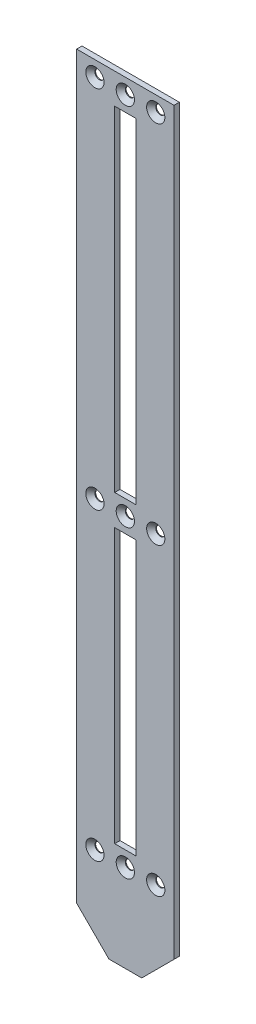
ISO-10303-21;
HEADER;
FILE_DESCRIPTION(('STEP AP214'),'2;1');
FILE_NAME('part.step','',(''),(''),'','','');
FILE_SCHEMA(('AUTOMOTIVE_DESIGN { 1 0 10303 214 1 1 1 1 }'));
ENDSEC;
DATA;
#1=APPLICATION_CONTEXT('core data for automotive mechanical design processes');
#2=APPLICATION_PROTOCOL_DEFINITION('international standard','automotive_design',2000,#1);
#3=PRODUCT_CONTEXT('',#1,'mechanical');
#4=PRODUCT('Part','Part','',(#3));
#5=PRODUCT_RELATED_PRODUCT_CATEGORY('part','',(#4));
#6=PRODUCT_DEFINITION_FORMATION('','',#4);
#7=PRODUCT_DEFINITION_CONTEXT('part definition',#1,'design');
#8=PRODUCT_DEFINITION('design','',#6,#7);
#9=PRODUCT_DEFINITION_SHAPE('','',#8);
#10=(LENGTH_UNIT() NAMED_UNIT(*) SI_UNIT(.MILLI.,.METRE.));
#11=(NAMED_UNIT(*) PLANE_ANGLE_UNIT() SI_UNIT($,.RADIAN.));
#12=(NAMED_UNIT(*) SI_UNIT($,.STERADIAN.) SOLID_ANGLE_UNIT());
#13=UNCERTAINTY_MEASURE_WITH_UNIT(LENGTH_MEASURE(1.E-05),#10,'distance_accuracy_value','');
#14=(GEOMETRIC_REPRESENTATION_CONTEXT(3) GLOBAL_UNCERTAINTY_ASSIGNED_CONTEXT((#13)) GLOBAL_UNIT_ASSIGNED_CONTEXT((#10,
#11,#12)) REPRESENTATION_CONTEXT('',''));
#15=CARTESIAN_POINT('',(0.,0.,0.));
#16=DIRECTION('',(0.,0.,1.));
#17=DIRECTION('',(1.,0.,0.));
#18=AXIS2_PLACEMENT_3D('',#15,#16,#17);
#19=CARTESIAN_POINT('',(32.,-23.1943262411348,-1.755));
#20=DIRECTION('',(1.,0.,0.));
#21=DIRECTION('',(0.,0.,-1.));
#22=AXIS2_PLACEMENT_3D('',#19,#20,#21);
#23=PLANE('',#22);
#24=DIRECTION('',(0.,1.,0.));
#25=VECTOR('',#24,1.);
#26=CARTESIAN_POINT('',(32.,-23.1943262411348,1.755));
#27=LINE('',#26,#25);
#28=CARTESIAN_POINT('',(32.,-23.1943262411348,1.755));
#29=VERTEX_POINT('',#28);
#30=CARTESIAN_POINT('',(32.,463.194326241135,1.755));
#31=VERTEX_POINT('',#30);
#32=EDGE_CURVE('E258',#29,#31,#27,.T.);
#33=ORIENTED_EDGE('',*,*,#32,.F.);
#34=DIRECTION('',(0.,0.,1.));
#35=VECTOR('',#34,1.);
#36=CARTESIAN_POINT('',(32.,-23.1943262411348,-1.755));
#37=LINE('',#36,#35);
#38=CARTESIAN_POINT('',(32.,-23.1943262411348,-1.755));
#39=VERTEX_POINT('',#38);
#40=EDGE_CURVE('E288',#39,#29,#37,.T.);
#41=ORIENTED_EDGE('',*,*,#40,.F.);
#42=DIRECTION('',(0.,1.,0.));
#43=VECTOR('',#42,1.);
#44=CARTESIAN_POINT('',(32.,23.1943262411348,-1.755));
#45=LINE('',#44,#43);
#46=CARTESIAN_POINT('',(32.,463.194326241135,-1.755));
#47=VERTEX_POINT('',#46);
#48=EDGE_CURVE('E255',#39,#47,#45,.T.);
#49=ORIENTED_EDGE('',*,*,#48,.T.);
#50=DIRECTION('',(0.,0.,1.));
#51=VECTOR('',#50,1.);
#52=CARTESIAN_POINT('',(32.,463.194326241135,-1.755));
#53=LINE('',#52,#51);
#54=EDGE_CURVE('E272',#47,#31,#53,.T.);
#55=ORIENTED_EDGE('',*,*,#54,.T.);
#56=EDGE_LOOP('',(#33,#41,#49,#55));
#57=FACE_BOUND('',#56,.T.);
#58=ADVANCED_FACE('F53',(#57),#23,.T.);
#59=CARTESIAN_POINT('',(32.,-23.1943262411348,-1.755));
#60=DIRECTION('',(0.707106781186544,-0.707106781186551,0.));
#61=DIRECTION('',(0.707106781186551,0.707106781186544,0.));
#62=AXIS2_PLACEMENT_3D('',#59,#60,#61);
#63=PLANE('',#62);
#64=DIRECTION('',(0.707106781186551,0.707106781186544,0.));
#65=VECTOR('',#64,1.);
#66=CARTESIAN_POINT('',(32.,-23.1943262411348,1.755));
#67=LINE('',#66,#65);
#68=CARTESIAN_POINT('',(10.7867965644035,-44.4075296767311,1.755));
#69=VERTEX_POINT('',#68);
#70=EDGE_CURVE('E284',#69,#29,#67,.T.);
#71=ORIENTED_EDGE('',*,*,#70,.F.);
#72=DIRECTION('',(0.,0.,1.));
#73=VECTOR('',#72,1.);
#74=CARTESIAN_POINT('',(10.7867965644035,-44.4075296767311,-1.755));
#75=LINE('',#74,#73);
#76=CARTESIAN_POINT('',(10.7867965644035,-44.4075296767311,-1.755));
#77=VERTEX_POINT('',#76);
#78=EDGE_CURVE('E291',#77,#69,#75,.T.);
#79=ORIENTED_EDGE('',*,*,#78,.F.);
#80=DIRECTION('',(0.707106781186551,0.707106781186544,0.));
#81=VECTOR('',#80,1.);
#82=CARTESIAN_POINT('',(32.,-23.1943262411348,-1.755));
#83=LINE('',#82,#81);
#84=EDGE_CURVE('E269',#77,#39,#83,.T.);
#85=ORIENTED_EDGE('',*,*,#84,.T.);
#86=ORIENTED_EDGE('',*,*,#40,.T.);
#87=EDGE_LOOP('',(#71,#79,#85,#86));
#88=FACE_BOUND('',#87,.T.);
#89=ADVANCED_FACE('F369',(#88),#63,.T.);
#90=CARTESIAN_POINT('',(-10.7867965644036,-44.4075296767312,-1.755));
#91=DIRECTION('',(0.,-1.,0.));
#92=DIRECTION('',(1.,0.,0.));
#93=AXIS2_PLACEMENT_3D('',#90,#91,#92);
#94=PLANE('',#93);
#95=DIRECTION('',(1.,0.,0.));
#96=VECTOR('',#95,1.);
#97=CARTESIAN_POINT('',(-10.7867965644036,-44.4075296767312,1.755));
#98=LINE('',#97,#96);
#99=CARTESIAN_POINT('',(-10.7867965644036,-44.4075296767312,1.755));
#100=VERTEX_POINT('',#99);
#101=EDGE_CURVE('E281',#100,#69,#98,.T.);
#102=ORIENTED_EDGE('',*,*,#101,.F.);
#103=DIRECTION('',(0.,0.,1.));
#104=VECTOR('',#103,1.);
#105=CARTESIAN_POINT('',(-10.7867965644036,-44.4075296767312,-1.755));
#106=LINE('',#105,#104);
#107=CARTESIAN_POINT('',(-10.7867965644036,-44.4075296767312,-1.755));
#108=VERTEX_POINT('',#107);
#109=EDGE_CURVE('E293',#108,#100,#106,.T.);
#110=ORIENTED_EDGE('',*,*,#109,.F.);
#111=DIRECTION('',(1.,0.,0.));
#112=VECTOR('',#111,1.);
#113=CARTESIAN_POINT('',(-10.7867965644036,-44.4075296767312,-1.755));
#114=LINE('',#113,#112);
#115=EDGE_CURVE('E266',#108,#77,#114,.T.);
#116=ORIENTED_EDGE('',*,*,#115,.T.);
#117=ORIENTED_EDGE('',*,*,#78,.T.);
#118=EDGE_LOOP('',(#102,#110,#116,#117));
#119=FACE_BOUND('',#118,.T.);
#120=ADVANCED_FACE('F375',(#119),#94,.T.);
#121=CARTESIAN_POINT('',(-32.,-23.1943262411348,-1.755));
#122=DIRECTION('',(-0.707106781186549,-0.707106781186546,0.));
#123=DIRECTION('',(0.707106781186546,-0.707106781186549,0.));
#124=AXIS2_PLACEMENT_3D('',#121,#122,#123);
#125=PLANE('',#124);
#126=DIRECTION('',(0.707106781186546,-0.707106781186549,0.));
#127=VECTOR('',#126,1.);
#128=CARTESIAN_POINT('',(-32.,-23.1943262411348,1.755));
#129=LINE('',#128,#127);
#130=CARTESIAN_POINT('',(-32.,-23.1943262411348,1.755));
#131=VERTEX_POINT('',#130);
#132=EDGE_CURVE('E278',#131,#100,#129,.T.);
#133=ORIENTED_EDGE('',*,*,#132,.F.);
#134=DIRECTION('',(0.,0.,1.));
#135=VECTOR('',#134,1.);
#136=CARTESIAN_POINT('',(-32.,-23.1943262411348,-1.755));
#137=LINE('',#136,#135);
#138=CARTESIAN_POINT('',(-32.,-23.1943262411348,-1.755));
#139=VERTEX_POINT('',#138);
#140=EDGE_CURVE('E295',#139,#131,#137,.T.);
#141=ORIENTED_EDGE('',*,*,#140,.F.);
#142=DIRECTION('',(0.707106781186546,-0.707106781186549,0.));
#143=VECTOR('',#142,1.);
#144=CARTESIAN_POINT('',(-32.,-23.1943262411348,-1.755));
#145=LINE('',#144,#143);
#146=EDGE_CURVE('E263',#139,#108,#145,.T.);
#147=ORIENTED_EDGE('',*,*,#146,.T.);
#148=ORIENTED_EDGE('',*,*,#109,.T.);
#149=EDGE_LOOP('',(#133,#141,#147,#148));
#150=FACE_BOUND('',#149,.T.);
#151=ADVANCED_FACE('F385',(#150),#125,.T.);
#152=CARTESIAN_POINT('',(-32.,-23.1943262411348,-1.755));
#153=DIRECTION('',(-1.,0.,0.));
#154=DIRECTION('',(0.,0.,1.));
#155=AXIS2_PLACEMENT_3D('',#152,#153,#154);
#156=PLANE('',#155);
#157=DIRECTION('',(0.,-1.,0.));
#158=VECTOR('',#157,1.);
#159=CARTESIAN_POINT('',(-32.,-23.1943262411348,1.755));
#160=LINE('',#159,#158);
#161=CARTESIAN_POINT('',(-32.,463.194326241135,1.755));
#162=VERTEX_POINT('',#161);
#163=EDGE_CURVE('E275',#162,#131,#160,.T.);
#164=ORIENTED_EDGE('',*,*,#163,.F.);
#165=DIRECTION('',(0.,0.,1.));
#166=VECTOR('',#165,1.);
#167=CARTESIAN_POINT('',(-32.,463.194326241135,-1.755));
#168=LINE('',#167,#166);
#169=CARTESIAN_POINT('',(-32.,463.194326241135,-1.755));
#170=VERTEX_POINT('',#169);
#171=EDGE_CURVE('E297',#170,#162,#168,.T.);
#172=ORIENTED_EDGE('',*,*,#171,.F.);
#173=DIRECTION('',(0.,-1.,0.));
#174=VECTOR('',#173,1.);
#175=CARTESIAN_POINT('',(-32.,443.194326241135,-1.755));
#176=LINE('',#175,#174);
#177=EDGE_CURVE('E261',#170,#139,#176,.T.);
#178=ORIENTED_EDGE('',*,*,#177,.T.);
#179=ORIENTED_EDGE('',*,*,#140,.T.);
#180=EDGE_LOOP('',(#164,#172,#178,#179));
#181=FACE_BOUND('',#180,.T.);
#182=ADVANCED_FACE('F389',(#181),#156,.T.);
#183=CARTESIAN_POINT('',(32.,463.194326241135,-1.755));
#184=DIRECTION('',(0.,1.,0.));
#185=DIRECTION('',(0.,0.,1.));
#186=AXIS2_PLACEMENT_3D('',#183,#184,#185);
#187=PLANE('',#186);
#188=DIRECTION('',(-1.,0.,0.));
#189=VECTOR('',#188,1.);
#190=CARTESIAN_POINT('',(32.,463.194326241135,1.755));
#191=LINE('',#190,#189);
#192=EDGE_CURVE('E248',#31,#162,#191,.T.);
#193=ORIENTED_EDGE('',*,*,#192,.F.);
#194=ORIENTED_EDGE('',*,*,#54,.F.);
#195=DIRECTION('',(-1.,0.,0.));
#196=VECTOR('',#195,1.);
#197=CARTESIAN_POINT('',(32.,463.194326241135,-1.755));
#198=LINE('',#197,#196);
#199=EDGE_CURVE('E257',#47,#170,#198,.T.);
#200=ORIENTED_EDGE('',*,*,#199,.T.);
#201=ORIENTED_EDGE('',*,*,#171,.T.);
#202=EDGE_LOOP('',(#193,#194,#200,#201));
#203=FACE_BOUND('',#202,.T.);
#204=ADVANCED_FACE('F393',(#203),#187,.T.);
#205=CARTESIAN_POINT('',(0.,0.,-1.755));
#206=DIRECTION('',(0.,0.,1.));
#207=DIRECTION('',(1.,0.,0.));
#208=AXIS2_PLACEMENT_3D('',#205,#206,#207);
#209=PLANE('',#208);
#210=CARTESIAN_POINT('',(0.,213.194326241135,-1.755));
#211=DIRECTION('',(0.,0.,1.));
#212=DIRECTION('',(1.,0.,0.));
#213=AXIS2_PLACEMENT_3D('',#210,#211,#212);
#214=CIRCLE('',#213,3.);
#215=CARTESIAN_POINT('',(3.,213.194326241135,-1.755));
#216=VERTEX_POINT('',#215);
#217=EDGE_CURVE('E207',#216,#216,#214,.T.);
#218=ORIENTED_EDGE('',*,*,#217,.T.);
#219=EDGE_LOOP('',(#218));
#220=FACE_BOUND('',#219,.T.);
#221=CARTESIAN_POINT('',(20.,213.194326241135,-1.755));
#222=DIRECTION('',(0.,0.,1.));
#223=DIRECTION('',(1.,0.,0.));
#224=AXIS2_PLACEMENT_3D('',#221,#222,#223);
#225=CIRCLE('',#224,3.);
#226=CARTESIAN_POINT('',(23.,213.194326241135,-1.755));
#227=VERTEX_POINT('',#226);
#228=EDGE_CURVE('E458',#227,#227,#225,.T.);
#229=ORIENTED_EDGE('',*,*,#228,.T.);
#230=EDGE_LOOP('',(#229));
#231=FACE_BOUND('',#230,.T.);
#232=CARTESIAN_POINT('',(0.,453.194326241135,-1.755));
#233=DIRECTION('',(0.,0.,1.));
#234=DIRECTION('',(1.,0.,0.));
#235=AXIS2_PLACEMENT_3D('',#232,#233,#234);
#236=CIRCLE('',#235,3.);
#237=CARTESIAN_POINT('',(3.,453.194326241135,-1.755));
#238=VERTEX_POINT('',#237);
#239=EDGE_CURVE('E460',#238,#238,#236,.T.);
#240=ORIENTED_EDGE('',*,*,#239,.T.);
#241=EDGE_LOOP('',(#240));
#242=FACE_BOUND('',#241,.T.);
#243=CARTESIAN_POINT('',(20.,453.194326241135,-1.755));
#244=DIRECTION('',(0.,0.,1.));
#245=DIRECTION('',(1.,0.,0.));
#246=AXIS2_PLACEMENT_3D('',#243,#244,#245);
#247=CIRCLE('',#246,3.);
#248=CARTESIAN_POINT('',(23.,453.194326241135,-1.755));
#249=VERTEX_POINT('',#248);
#250=EDGE_CURVE('E463',#249,#249,#247,.T.);
#251=ORIENTED_EDGE('',*,*,#250,.T.);
#252=EDGE_LOOP('',(#251));
#253=FACE_BOUND('',#252,.T.);
#254=CARTESIAN_POINT('',(-20.,13.1943262411348,-1.755));
#255=DIRECTION('',(0.,0.,1.));
#256=DIRECTION('',(1.,0.,0.));
#257=AXIS2_PLACEMENT_3D('',#254,#255,#256);
#258=CIRCLE('',#257,3.);
#259=CARTESIAN_POINT('',(-17.,13.1943262411348,-1.755));
#260=VERTEX_POINT('',#259);
#261=EDGE_CURVE('E468',#260,#260,#258,.T.);
#262=ORIENTED_EDGE('',*,*,#261,.T.);
#263=EDGE_LOOP('',(#262));
#264=FACE_BOUND('',#263,.T.);
#265=CARTESIAN_POINT('',(20.,13.1943262411347,-1.755));
#266=DIRECTION('',(0.,0.,1.));
#267=DIRECTION('',(1.,0.,0.));
#268=AXIS2_PLACEMENT_3D('',#265,#266,#267);
#269=CIRCLE('',#268,3.);
#270=CARTESIAN_POINT('',(23.,13.1943262411347,-1.755));
#271=VERTEX_POINT('',#270);
#272=EDGE_CURVE('E471',#271,#271,#269,.T.);
#273=ORIENTED_EDGE('',*,*,#272,.T.);
#274=EDGE_LOOP('',(#273));
#275=FACE_BOUND('',#274,.T.);
#276=CARTESIAN_POINT('',(0.,13.1943262411347,-1.755));
#277=DIRECTION('',(0.,0.,1.));
#278=DIRECTION('',(1.,0.,0.));
#279=AXIS2_PLACEMENT_3D('',#276,#277,#278);
#280=CIRCLE('',#279,3.);
#281=CARTESIAN_POINT('',(3.,13.1943262411347,-1.755));
#282=VERTEX_POINT('',#281);
#283=EDGE_CURVE('E474',#282,#282,#280,.T.);
#284=ORIENTED_EDGE('',*,*,#283,.T.);
#285=EDGE_LOOP('',(#284));
#286=FACE_BOUND('',#285,.T.);
#287=CARTESIAN_POINT('',(-20.,453.194326241135,-1.755));
#288=DIRECTION('',(0.,0.,1.));
#289=DIRECTION('',(1.,0.,0.));
#290=AXIS2_PLACEMENT_3D('',#287,#288,#289);
#291=CIRCLE('',#290,3.);
#292=CARTESIAN_POINT('',(-17.,453.194326241135,-1.755));
#293=VERTEX_POINT('',#292);
#294=EDGE_CURVE('E477',#293,#293,#291,.T.);
#295=ORIENTED_EDGE('',*,*,#294,.T.);
#296=EDGE_LOOP('',(#295));
#297=FACE_BOUND('',#296,.T.);
#298=CARTESIAN_POINT('',(-20.,213.194326241135,-1.755));
#299=DIRECTION('',(0.,0.,1.));
#300=DIRECTION('',(1.,0.,0.));
#301=AXIS2_PLACEMENT_3D('',#298,#299,#300);
#302=CIRCLE('',#301,3.);
#303=CARTESIAN_POINT('',(-17.,213.194326241135,-1.755));
#304=VERTEX_POINT('',#303);
#305=EDGE_CURVE('E480',#304,#304,#302,.T.);
#306=ORIENTED_EDGE('',*,*,#305,.T.);
#307=EDGE_LOOP('',(#306));
#308=FACE_BOUND('',#307,.T.);
#309=DIRECTION('',(0.,1.,0.));
#310=VECTOR('',#309,1.);
#311=CARTESIAN_POINT('',(7.,223.194326241135,-1.755));
#312=LINE('',#311,#310);
#313=CARTESIAN_POINT('',(7.,223.194326241135,-1.755));
#314=VERTEX_POINT('',#313);
#315=CARTESIAN_POINT('',(7.,443.194326241135,-1.755));
#316=VERTEX_POINT('',#315);
#317=EDGE_CURVE('E191',#314,#316,#312,.T.);
#318=ORIENTED_EDGE('',*,*,#317,.T.);
#319=DIRECTION('',(-1.,0.,0.));
#320=VECTOR('',#319,1.);
#321=CARTESIAN_POINT('',(7.,443.194326241135,-1.755));
#322=LINE('',#321,#320);
#323=CARTESIAN_POINT('',(-7.,443.194326241135,-1.755));
#324=VERTEX_POINT('',#323);
#325=EDGE_CURVE('E185',#316,#324,#322,.T.);
#326=ORIENTED_EDGE('',*,*,#325,.T.);
#327=DIRECTION('',(0.,-1.,0.));
#328=VECTOR('',#327,1.);
#329=CARTESIAN_POINT('',(-7.,223.194326241135,-1.755));
#330=LINE('',#329,#328);
#331=CARTESIAN_POINT('',(-7.,223.194326241135,-1.755));
#332=VERTEX_POINT('',#331);
#333=EDGE_CURVE('E194',#324,#332,#330,.T.);
#334=ORIENTED_EDGE('',*,*,#333,.T.);
#335=DIRECTION('',(1.,0.,0.));
#336=VECTOR('',#335,1.);
#337=CARTESIAN_POINT('',(7.,223.194326241135,-1.755));
#338=LINE('',#337,#336);
#339=EDGE_CURVE('E72',#332,#314,#338,.T.);
#340=ORIENTED_EDGE('',*,*,#339,.T.);
#341=EDGE_LOOP('',(#318,#326,#334,#340));
#342=FACE_BOUND('',#341,.T.);
#343=DIRECTION('',(0.,1.,0.));
#344=VECTOR('',#343,1.);
#345=CARTESIAN_POINT('',(7.,23.1943262411347,-1.755));
#346=LINE('',#345,#344);
#347=CARTESIAN_POINT('',(7.,23.1943262411347,-1.755));
#348=VERTEX_POINT('',#347);
#349=CARTESIAN_POINT('',(7.,203.194326241135,-1.755));
#350=VERTEX_POINT('',#349);
#351=EDGE_CURVE('E233',#348,#350,#346,.T.);
#352=ORIENTED_EDGE('',*,*,#351,.T.);
#353=DIRECTION('',(-1.,0.,0.));
#354=VECTOR('',#353,1.);
#355=CARTESIAN_POINT('',(7.,203.194326241135,-1.755));
#356=LINE('',#355,#354);
#357=CARTESIAN_POINT('',(-7.,203.194326241135,-1.755));
#358=VERTEX_POINT('',#357);
#359=EDGE_CURVE('E223',#350,#358,#356,.T.);
#360=ORIENTED_EDGE('',*,*,#359,.T.);
#361=DIRECTION('',(0.,-1.,0.));
#362=VECTOR('',#361,1.);
#363=CARTESIAN_POINT('',(-7.,23.1943262411347,-1.755));
#364=LINE('',#363,#362);
#365=CARTESIAN_POINT('',(-7.,23.1943262411347,-1.755));
#366=VERTEX_POINT('',#365);
#367=EDGE_CURVE('E226',#358,#366,#364,.T.);
#368=ORIENTED_EDGE('',*,*,#367,.T.);
#369=DIRECTION('',(1.,0.,0.));
#370=VECTOR('',#369,1.);
#371=CARTESIAN_POINT('',(-7.,23.1943262411347,-1.755));
#372=LINE('',#371,#370);
#373=EDGE_CURVE('E230',#366,#348,#372,.T.);
#374=ORIENTED_EDGE('',*,*,#373,.T.);
#375=EDGE_LOOP('',(#352,#360,#368,#374));
#376=FACE_BOUND('',#375,.T.);
#377=ORIENTED_EDGE('',*,*,#48,.F.);
#378=ORIENTED_EDGE('',*,*,#84,.F.);
#379=ORIENTED_EDGE('',*,*,#115,.F.);
#380=ORIENTED_EDGE('',*,*,#146,.F.);
#381=ORIENTED_EDGE('',*,*,#177,.F.);
#382=ORIENTED_EDGE('',*,*,#199,.F.);
#383=EDGE_LOOP('',(#377,#378,#379,#380,#381,#382));
#384=FACE_BOUND('',#383,.T.);
#385=ADVANCED_FACE('F198',(#220,#231,#242,#253,#264,#275,#286,#297,#308,#342,#376,#384),#209,.F.);
#386=CARTESIAN_POINT('',(0.,0.,1.755));
#387=DIRECTION('',(0.,0.,1.));
#388=DIRECTION('',(1.,0.,0.));
#389=AXIS2_PLACEMENT_3D('',#386,#387,#388);
#390=PLANE('',#389);
#391=CARTESIAN_POINT('',(-20.,13.1943262411348,1.755));
#392=DIRECTION('',(0.,0.,1.));
#393=DIRECTION('',(1.,0.,0.));
#394=AXIS2_PLACEMENT_3D('',#391,#392,#393);
#395=CIRCLE('',#394,6.00000000000001);
#396=CARTESIAN_POINT('',(-14.,13.1943262411348,1.755));
#397=VERTEX_POINT('',#396);
#398=EDGE_CURVE('E328',#397,#397,#395,.F.);
#399=ORIENTED_EDGE('',*,*,#398,.T.);
#400=EDGE_LOOP('',(#399));
#401=FACE_BOUND('',#400,.T.);
#402=CARTESIAN_POINT('',(0.,13.1943262411347,1.755));
#403=DIRECTION('',(0.,0.,1.));
#404=DIRECTION('',(1.,0.,0.));
#405=AXIS2_PLACEMENT_3D('',#402,#403,#404);
#406=CIRCLE('',#405,6.00000000000001);
#407=CARTESIAN_POINT('',(6.00000000000001,13.1943262411347,1.755));
#408=VERTEX_POINT('',#407);
#409=EDGE_CURVE('E325',#408,#408,#406,.F.);
#410=ORIENTED_EDGE('',*,*,#409,.T.);
#411=EDGE_LOOP('',(#410));
#412=FACE_BOUND('',#411,.T.);
#413=CARTESIAN_POINT('',(20.,13.1943262411347,1.755));
#414=DIRECTION('',(0.,0.,1.));
#415=DIRECTION('',(1.,0.,0.));
#416=AXIS2_PLACEMENT_3D('',#413,#414,#415);
#417=CIRCLE('',#416,6.);
#418=CARTESIAN_POINT('',(26.,13.1943262411347,1.755));
#419=VERTEX_POINT('',#418);
#420=EDGE_CURVE('E322',#419,#419,#417,.F.);
#421=ORIENTED_EDGE('',*,*,#420,.T.);
#422=EDGE_LOOP('',(#421));
#423=FACE_BOUND('',#422,.T.);
#424=CARTESIAN_POINT('',(-20.,213.194326241135,1.755));
#425=DIRECTION('',(0.,0.,1.));
#426=DIRECTION('',(1.,0.,0.));
#427=AXIS2_PLACEMENT_3D('',#424,#425,#426);
#428=CIRCLE('',#427,6.00000000000001);
#429=CARTESIAN_POINT('',(-14.,213.194326241135,1.755));
#430=VERTEX_POINT('',#429);
#431=EDGE_CURVE('E319',#430,#430,#428,.F.);
#432=ORIENTED_EDGE('',*,*,#431,.T.);
#433=EDGE_LOOP('',(#432));
#434=FACE_BOUND('',#433,.T.);
#435=CARTESIAN_POINT('',(0.,213.194326241135,1.755));
#436=DIRECTION('',(0.,0.,1.));
#437=DIRECTION('',(1.,0.,0.));
#438=AXIS2_PLACEMENT_3D('',#435,#436,#437);
#439=CIRCLE('',#438,6.00000000000001);
#440=CARTESIAN_POINT('',(6.00000000000001,213.194326241135,1.755));
#441=VERTEX_POINT('',#440);
#442=EDGE_CURVE('E316',#441,#441,#439,.F.);
#443=ORIENTED_EDGE('',*,*,#442,.T.);
#444=EDGE_LOOP('',(#443));
#445=FACE_BOUND('',#444,.T.);
#446=CARTESIAN_POINT('',(20.,213.194326241135,1.755));
#447=DIRECTION('',(0.,0.,1.));
#448=DIRECTION('',(1.,0.,0.));
#449=AXIS2_PLACEMENT_3D('',#446,#447,#448);
#450=CIRCLE('',#449,6.00000000000001);
#451=CARTESIAN_POINT('',(26.,213.194326241135,1.755));
#452=VERTEX_POINT('',#451);
#453=EDGE_CURVE('E313',#452,#452,#450,.F.);
#454=ORIENTED_EDGE('',*,*,#453,.T.);
#455=EDGE_LOOP('',(#454));
#456=FACE_BOUND('',#455,.T.);
#457=CARTESIAN_POINT('',(20.,453.194326241135,1.755));
#458=DIRECTION('',(0.,0.,1.));
#459=DIRECTION('',(1.,0.,0.));
#460=AXIS2_PLACEMENT_3D('',#457,#458,#459);
#461=CIRCLE('',#460,6.00000000000001);
#462=CARTESIAN_POINT('',(26.,453.194326241135,1.755));
#463=VERTEX_POINT('',#462);
#464=EDGE_CURVE('E310',#463,#463,#461,.F.);
#465=ORIENTED_EDGE('',*,*,#464,.T.);
#466=EDGE_LOOP('',(#465));
#467=FACE_BOUND('',#466,.T.);
#468=CARTESIAN_POINT('',(0.,453.194326241135,1.755));
#469=DIRECTION('',(0.,0.,1.));
#470=DIRECTION('',(1.,0.,0.));
#471=AXIS2_PLACEMENT_3D('',#468,#469,#470);
#472=CIRCLE('',#471,6.00000000000001);
#473=CARTESIAN_POINT('',(6.00000000000001,453.194326241135,1.755));
#474=VERTEX_POINT('',#473);
#475=EDGE_CURVE('E307',#474,#474,#472,.F.);
#476=ORIENTED_EDGE('',*,*,#475,.T.);
#477=EDGE_LOOP('',(#476));
#478=FACE_BOUND('',#477,.T.);
#479=CARTESIAN_POINT('',(-20.,453.194326241135,1.755));
#480=DIRECTION('',(0.,0.,1.));
#481=DIRECTION('',(1.,0.,0.));
#482=AXIS2_PLACEMENT_3D('',#479,#480,#481);
#483=CIRCLE('',#482,6.00000000000001);
#484=CARTESIAN_POINT('',(-14.,453.194326241135,1.755));
#485=VERTEX_POINT('',#484);
#486=EDGE_CURVE('E304',#485,#485,#483,.F.);
#487=ORIENTED_EDGE('',*,*,#486,.T.);
#488=EDGE_LOOP('',(#487));
#489=FACE_BOUND('',#488,.T.);
#490=DIRECTION('',(-1.,0.,0.));
#491=VECTOR('',#490,1.);
#492=CARTESIAN_POINT('',(7.,443.194326241135,1.755));
#493=LINE('',#492,#491);
#494=CARTESIAN_POINT('',(7.,443.194326241135,1.755));
#495=VERTEX_POINT('',#494);
#496=CARTESIAN_POINT('',(-7.,443.194326241135,1.755));
#497=VERTEX_POINT('',#496);
#498=EDGE_CURVE('E82',#495,#497,#493,.T.);
#499=ORIENTED_EDGE('',*,*,#498,.F.);
#500=DIRECTION('',(0.,1.,0.));
#501=VECTOR('',#500,1.);
#502=CARTESIAN_POINT('',(7.,223.194326241135,1.755));
#503=LINE('',#502,#501);
#504=CARTESIAN_POINT('',(7.,223.194326241135,1.755));
#505=VERTEX_POINT('',#504);
#506=EDGE_CURVE('E201',#505,#495,#503,.T.);
#507=ORIENTED_EDGE('',*,*,#506,.F.);
#508=DIRECTION('',(1.,0.,0.));
#509=VECTOR('',#508,1.);
#510=CARTESIAN_POINT('',(7.,223.194326241135,1.755));
#511=LINE('',#510,#509);
#512=CARTESIAN_POINT('',(-7.,223.194326241135,1.755));
#513=VERTEX_POINT('',#512);
#514=EDGE_CURVE('E204',#513,#505,#511,.T.);
#515=ORIENTED_EDGE('',*,*,#514,.F.);
#516=DIRECTION('',(0.,-1.,0.));
#517=VECTOR('',#516,1.);
#518=CARTESIAN_POINT('',(-7.,223.194326241135,1.755));
#519=LINE('',#518,#517);
#520=EDGE_CURVE('E213',#497,#513,#519,.T.);
#521=ORIENTED_EDGE('',*,*,#520,.F.);
#522=EDGE_LOOP('',(#499,#507,#515,#521));
#523=FACE_BOUND('',#522,.T.);
#524=DIRECTION('',(-1.,0.,0.));
#525=VECTOR('',#524,1.);
#526=CARTESIAN_POINT('',(7.,203.194326241135,1.755));
#527=LINE('',#526,#525);
#528=CARTESIAN_POINT('',(7.,203.194326241135,1.755));
#529=VERTEX_POINT('',#528);
#530=CARTESIAN_POINT('',(-7.,203.194326241135,1.755));
#531=VERTEX_POINT('',#530);
#532=EDGE_CURVE('E219',#529,#531,#527,.T.);
#533=ORIENTED_EDGE('',*,*,#532,.F.);
#534=DIRECTION('',(0.,1.,0.));
#535=VECTOR('',#534,1.);
#536=CARTESIAN_POINT('',(7.,23.1943262411347,1.755));
#537=LINE('',#536,#535);
#538=CARTESIAN_POINT('',(7.,23.1943262411347,1.755));
#539=VERTEX_POINT('',#538);
#540=EDGE_CURVE('E227',#539,#529,#537,.T.);
#541=ORIENTED_EDGE('',*,*,#540,.F.);
#542=DIRECTION('',(1.,0.,0.));
#543=VECTOR('',#542,1.);
#544=CARTESIAN_POINT('',(-7.,23.1943262411347,1.755));
#545=LINE('',#544,#543);
#546=CARTESIAN_POINT('',(-7.,23.1943262411347,1.755));
#547=VERTEX_POINT('',#546);
#548=EDGE_CURVE('E241',#547,#539,#545,.T.);
#549=ORIENTED_EDGE('',*,*,#548,.F.);
#550=DIRECTION('',(0.,-1.,0.));
#551=VECTOR('',#550,1.);
#552=CARTESIAN_POINT('',(-7.,23.1943262411347,1.755));
#553=LINE('',#552,#551);
#554=EDGE_CURVE('E238',#531,#547,#553,.T.);
#555=ORIENTED_EDGE('',*,*,#554,.F.);
#556=EDGE_LOOP('',(#533,#541,#549,#555));
#557=FACE_BOUND('',#556,.T.);
#558=ORIENTED_EDGE('',*,*,#32,.T.);
#559=ORIENTED_EDGE('',*,*,#192,.T.);
#560=ORIENTED_EDGE('',*,*,#163,.T.);
#561=ORIENTED_EDGE('',*,*,#132,.T.);
#562=ORIENTED_EDGE('',*,*,#101,.T.);
#563=ORIENTED_EDGE('',*,*,#70,.T.);
#564=EDGE_LOOP('',(#558,#559,#560,#561,#562,#563));
#565=FACE_BOUND('',#564,.T.);
#566=ADVANCED_FACE('F380',(#401,#412,#423,#434,#445,#456,#467,#478,#489,#523,#557,#565),#390,.T.);
#567=CARTESIAN_POINT('',(7.,203.194326241135,-1.755));
#568=DIRECTION('',(0.,1.,0.));
#569=DIRECTION('',(0.,0.,1.));
#570=AXIS2_PLACEMENT_3D('',#567,#568,#569);
#571=PLANE('',#570);
#572=ORIENTED_EDGE('',*,*,#532,.T.);
#573=DIRECTION('',(0.,0.,1.));
#574=VECTOR('',#573,1.);
#575=CARTESIAN_POINT('',(-7.,203.194326241135,-1.755));
#576=LINE('',#575,#574);
#577=EDGE_CURVE('E236',#358,#531,#576,.T.);
#578=ORIENTED_EDGE('',*,*,#577,.F.);
#579=ORIENTED_EDGE('',*,*,#359,.F.);
#580=DIRECTION('',(0.,0.,1.));
#581=VECTOR('',#580,1.);
#582=CARTESIAN_POINT('',(7.,203.194326241135,-1.755));
#583=LINE('',#582,#581);
#584=EDGE_CURVE('E246',#350,#529,#583,.T.);
#585=ORIENTED_EDGE('',*,*,#584,.T.);
#586=EDGE_LOOP('',(#572,#578,#579,#585));
#587=FACE_BOUND('',#586,.T.);
#588=ADVANCED_FACE('F516',(#587),#571,.F.);
#589=CARTESIAN_POINT('',(7.,23.1943262411347,-1.755));
#590=DIRECTION('',(1.,0.,0.));
#591=DIRECTION('',(0.,1.,0.));
#592=AXIS2_PLACEMENT_3D('',#589,#590,#591);
#593=PLANE('',#592);
#594=ORIENTED_EDGE('',*,*,#540,.T.);
#595=ORIENTED_EDGE('',*,*,#584,.F.);
#596=ORIENTED_EDGE('',*,*,#351,.F.);
#597=DIRECTION('',(0.,0.,1.));
#598=VECTOR('',#597,1.);
#599=CARTESIAN_POINT('',(7.,23.1943262411347,-1.755));
#600=LINE('',#599,#598);
#601=EDGE_CURVE('E249',#348,#539,#600,.T.);
#602=ORIENTED_EDGE('',*,*,#601,.T.);
#603=EDGE_LOOP('',(#594,#595,#596,#602));
#604=FACE_BOUND('',#603,.T.);
#605=ADVANCED_FACE('F512',(#604),#593,.F.);
#606=CARTESIAN_POINT('',(-7.,23.1943262411347,-1.755));
#607=DIRECTION('',(0.,-1.,0.));
#608=DIRECTION('',(1.,0.,0.));
#609=AXIS2_PLACEMENT_3D('',#606,#607,#608);
#610=PLANE('',#609);
#611=ORIENTED_EDGE('',*,*,#548,.T.);
#612=ORIENTED_EDGE('',*,*,#601,.F.);
#613=ORIENTED_EDGE('',*,*,#373,.F.);
#614=DIRECTION('',(0.,0.,1.));
#615=VECTOR('',#614,1.);
#616=CARTESIAN_POINT('',(-7.,23.1943262411347,-1.755));
#617=LINE('',#616,#615);
#618=EDGE_CURVE('E251',#366,#547,#617,.T.);
#619=ORIENTED_EDGE('',*,*,#618,.T.);
#620=EDGE_LOOP('',(#611,#612,#613,#619));
#621=FACE_BOUND('',#620,.T.);
#622=ADVANCED_FACE('F515',(#621),#610,.F.);
#623=CARTESIAN_POINT('',(-7.,23.1943262411347,-1.755));
#624=DIRECTION('',(-1.,0.,0.));
#625=DIRECTION('',(0.,0.,1.));
#626=AXIS2_PLACEMENT_3D('',#623,#624,#625);
#627=PLANE('',#626);
#628=ORIENTED_EDGE('',*,*,#554,.T.);
#629=ORIENTED_EDGE('',*,*,#618,.F.);
#630=ORIENTED_EDGE('',*,*,#367,.F.);
#631=ORIENTED_EDGE('',*,*,#577,.T.);
#632=EDGE_LOOP('',(#628,#629,#630,#631));
#633=FACE_BOUND('',#632,.T.);
#634=ADVANCED_FACE('F511',(#633),#627,.F.);
#635=CARTESIAN_POINT('',(7.,443.194326241135,-1.755));
#636=DIRECTION('',(0.,1.,0.));
#637=DIRECTION('',(0.,0.,1.));
#638=AXIS2_PLACEMENT_3D('',#635,#636,#637);
#639=PLANE('',#638);
#640=ORIENTED_EDGE('',*,*,#498,.T.);
#641=DIRECTION('',(0.,0.,1.));
#642=VECTOR('',#641,1.);
#643=CARTESIAN_POINT('',(-7.,443.194326241135,-1.755));
#644=LINE('',#643,#642);
#645=EDGE_CURVE('E181',#324,#497,#644,.T.);
#646=ORIENTED_EDGE('',*,*,#645,.F.);
#647=ORIENTED_EDGE('',*,*,#325,.F.);
#648=DIRECTION('',(0.,0.,1.));
#649=VECTOR('',#648,1.);
#650=CARTESIAN_POINT('',(7.,443.194326241135,-1.755));
#651=LINE('',#650,#649);
#652=EDGE_CURVE('E217',#316,#495,#651,.T.);
#653=ORIENTED_EDGE('',*,*,#652,.T.);
#654=EDGE_LOOP('',(#640,#646,#647,#653));
#655=FACE_BOUND('',#654,.T.);
#656=ADVANCED_FACE('F183',(#655),#639,.F.);
#657=CARTESIAN_POINT('',(7.,223.194326241135,-1.755));
#658=DIRECTION('',(1.,0.,0.));
#659=DIRECTION('',(0.,0.,-1.));
#660=AXIS2_PLACEMENT_3D('',#657,#658,#659);
#661=PLANE('',#660);
#662=ORIENTED_EDGE('',*,*,#506,.T.);
#663=ORIENTED_EDGE('',*,*,#652,.F.);
#664=ORIENTED_EDGE('',*,*,#317,.F.);
#665=DIRECTION('',(0.,0.,1.));
#666=VECTOR('',#665,1.);
#667=CARTESIAN_POINT('',(7.,223.194326241135,-1.755));
#668=LINE('',#667,#666);
#669=EDGE_CURVE('E220',#314,#505,#668,.T.);
#670=ORIENTED_EDGE('',*,*,#669,.T.);
#671=EDGE_LOOP('',(#662,#663,#664,#670));
#672=FACE_BOUND('',#671,.T.);
#673=ADVANCED_FACE('F503',(#672),#661,.F.);
#674=CARTESIAN_POINT('',(7.,223.194326241135,-1.755));
#675=DIRECTION('',(0.,-1.,0.));
#676=DIRECTION('',(0.,0.,-1.));
#677=AXIS2_PLACEMENT_3D('',#674,#675,#676);
#678=PLANE('',#677);
#679=ORIENTED_EDGE('',*,*,#514,.T.);
#680=ORIENTED_EDGE('',*,*,#669,.F.);
#681=ORIENTED_EDGE('',*,*,#339,.F.);
#682=DIRECTION('',(0.,0.,1.));
#683=VECTOR('',#682,1.);
#684=CARTESIAN_POINT('',(-7.,223.194326241135,-1.755));
#685=LINE('',#684,#683);
#686=EDGE_CURVE('E190',#332,#513,#685,.T.);
#687=ORIENTED_EDGE('',*,*,#686,.T.);
#688=EDGE_LOOP('',(#679,#680,#681,#687));
#689=FACE_BOUND('',#688,.T.);
#690=ADVANCED_FACE('F497',(#689),#678,.F.);
#691=CARTESIAN_POINT('',(-7.,223.194326241135,-1.755));
#692=DIRECTION('',(-1.,0.,0.));
#693=DIRECTION('',(0.,0.,1.));
#694=AXIS2_PLACEMENT_3D('',#691,#692,#693);
#695=PLANE('',#694);
#696=ORIENTED_EDGE('',*,*,#520,.T.);
#697=ORIENTED_EDGE('',*,*,#686,.F.);
#698=ORIENTED_EDGE('',*,*,#333,.F.);
#699=ORIENTED_EDGE('',*,*,#645,.T.);
#700=EDGE_LOOP('',(#696,#697,#698,#699));
#701=FACE_BOUND('',#700,.T.);
#702=ADVANCED_FACE('F195',(#701),#695,.F.);
#703=CARTESIAN_POINT('',(-20.,213.194326241135,-8.245));
#704=DIRECTION('',(0.,0.,1.));
#705=DIRECTION('',(1.,0.,0.));
#706=AXIS2_PLACEMENT_3D('',#703,#704,#705);
#707=CYLINDRICAL_SURFACE('',#706,3.);
#708=CARTESIAN_POINT('',(-20.,213.194326241135,-1.24500000000001));
#709=DIRECTION('',(0.,0.,1.));
#710=DIRECTION('',(1.,0.,0.));
#711=AXIS2_PLACEMENT_3D('',#708,#709,#710);
#712=CIRCLE('',#711,3.);
#713=CARTESIAN_POINT('',(-17.,213.194326241135,-1.24500000000001));
#714=VERTEX_POINT('',#713);
#715=EDGE_CURVE('E337',#714,#714,#712,.T.);
#716=ORIENTED_EDGE('',*,*,#715,.T.);
#717=EDGE_LOOP('',(#716));
#718=FACE_BOUND('',#717,.T.);
#719=ORIENTED_EDGE('',*,*,#305,.F.);
#720=EDGE_LOOP('',(#719));
#721=FACE_BOUND('',#720,.T.);
#722=ADVANCED_FACE('F485',(#718,#721),#707,.F.);
#723=CARTESIAN_POINT('',(-20.,453.194326241135,-8.245));
#724=DIRECTION('',(0.,0.,1.));
#725=DIRECTION('',(1.,0.,0.));
#726=AXIS2_PLACEMENT_3D('',#723,#724,#725);
#727=CYLINDRICAL_SURFACE('',#726,3.);
#728=CARTESIAN_POINT('',(-20.,453.194326241135,-1.24500000000002));
#729=DIRECTION('',(0.,0.,1.));
#730=DIRECTION('',(1.,0.,0.));
#731=AXIS2_PLACEMENT_3D('',#728,#729,#730);
#732=CIRCLE('',#731,3.);
#733=CARTESIAN_POINT('',(-17.,453.194326241135,-1.24500000000002));
#734=VERTEX_POINT('',#733);
#735=EDGE_CURVE('E11',#734,#734,#732,.T.);
#736=ORIENTED_EDGE('',*,*,#735,.T.);
#737=EDGE_LOOP('',(#736));
#738=FACE_BOUND('',#737,.T.);
#739=ORIENTED_EDGE('',*,*,#294,.F.);
#740=EDGE_LOOP('',(#739));
#741=FACE_BOUND('',#740,.T.);
#742=ADVANCED_FACE('F487',(#738,#741),#727,.F.);
#743=CARTESIAN_POINT('',(0.,13.1943262411347,-8.245));
#744=DIRECTION('',(0.,0.,1.));
#745=DIRECTION('',(1.,0.,0.));
#746=AXIS2_PLACEMENT_3D('',#743,#744,#745);
#747=CYLINDRICAL_SURFACE('',#746,3.);
#748=CARTESIAN_POINT('',(0.,13.1943262411347,-1.24500000000002));
#749=DIRECTION('',(0.,0.,1.));
#750=DIRECTION('',(1.,0.,0.));
#751=AXIS2_PLACEMENT_3D('',#748,#749,#750);
#752=CIRCLE('',#751,3.);
#753=CARTESIAN_POINT('',(3.,13.1943262411347,-1.24500000000002));
#754=VERTEX_POINT('',#753);
#755=EDGE_CURVE('E331',#754,#754,#752,.T.);
#756=ORIENTED_EDGE('',*,*,#755,.T.);
#757=EDGE_LOOP('',(#756));
#758=FACE_BOUND('',#757,.T.);
#759=ORIENTED_EDGE('',*,*,#283,.F.);
#760=EDGE_LOOP('',(#759));
#761=FACE_BOUND('',#760,.T.);
#762=ADVANCED_FACE('F494',(#758,#761),#747,.F.);
#763=CARTESIAN_POINT('',(20.,13.1943262411347,-8.245));
#764=DIRECTION('',(0.,0.,1.));
#765=DIRECTION('',(1.,0.,0.));
#766=AXIS2_PLACEMENT_3D('',#763,#764,#765);
#767=CYLINDRICAL_SURFACE('',#766,3.);
#768=CARTESIAN_POINT('',(20.,13.1943262411347,-1.24500000000002));
#769=DIRECTION('',(0.,0.,1.));
#770=DIRECTION('',(1.,0.,0.));
#771=AXIS2_PLACEMENT_3D('',#768,#769,#770);
#772=CIRCLE('',#771,3.);
#773=CARTESIAN_POINT('',(23.,13.1943262411347,-1.24500000000002));
#774=VERTEX_POINT('',#773);
#775=EDGE_CURVE('E334',#774,#774,#772,.T.);
#776=ORIENTED_EDGE('',*,*,#775,.T.);
#777=EDGE_LOOP('',(#776));
#778=FACE_BOUND('',#777,.T.);
#779=ORIENTED_EDGE('',*,*,#272,.F.);
#780=EDGE_LOOP('',(#779));
#781=FACE_BOUND('',#780,.T.);
#782=ADVANCED_FACE('F549',(#778,#781),#767,.F.);
#783=CARTESIAN_POINT('',(-20.,13.1943262411348,-8.245));
#784=DIRECTION('',(0.,0.,1.));
#785=DIRECTION('',(1.,0.,0.));
#786=AXIS2_PLACEMENT_3D('',#783,#784,#785);
#787=CYLINDRICAL_SURFACE('',#786,3.);
#788=CARTESIAN_POINT('',(-20.,13.1943262411348,-1.24500000000002));
#789=DIRECTION('',(0.,0.,1.));
#790=DIRECTION('',(1.,0.,0.));
#791=AXIS2_PLACEMENT_3D('',#788,#789,#790);
#792=CIRCLE('',#791,3.);
#793=CARTESIAN_POINT('',(-17.,13.1943262411348,-1.24500000000002));
#794=VERTEX_POINT('',#793);
#795=EDGE_CURVE('E290',#794,#794,#792,.T.);
#796=ORIENTED_EDGE('',*,*,#795,.T.);
#797=EDGE_LOOP('',(#796));
#798=FACE_BOUND('',#797,.T.);
#799=ORIENTED_EDGE('',*,*,#261,.F.);
#800=EDGE_LOOP('',(#799));
#801=FACE_BOUND('',#800,.T.);
#802=ADVANCED_FACE('F555',(#798,#801),#787,.F.);
#803=CARTESIAN_POINT('',(20.,453.194326241135,-8.245));
#804=DIRECTION('',(0.,0.,1.));
#805=DIRECTION('',(1.,0.,0.));
#806=AXIS2_PLACEMENT_3D('',#803,#804,#805);
#807=CYLINDRICAL_SURFACE('',#806,3.);
#808=CARTESIAN_POINT('',(20.,453.194326241135,-1.24500000000001));
#809=DIRECTION('',(0.,0.,1.));
#810=DIRECTION('',(1.,0.,0.));
#811=AXIS2_PLACEMENT_3D('',#808,#809,#810);
#812=CIRCLE('',#811,3.);
#813=CARTESIAN_POINT('',(23.,453.194326241135,-1.24500000000001));
#814=VERTEX_POINT('',#813);
#815=EDGE_CURVE('E346',#814,#814,#812,.T.);
#816=ORIENTED_EDGE('',*,*,#815,.T.);
#817=EDGE_LOOP('',(#816));
#818=FACE_BOUND('',#817,.T.);
#819=ORIENTED_EDGE('',*,*,#250,.F.);
#820=EDGE_LOOP('',(#819));
#821=FACE_BOUND('',#820,.T.);
#822=ADVANCED_FACE('F501',(#818,#821),#807,.F.);
#823=CARTESIAN_POINT('',(0.,453.194326241135,-8.245));
#824=DIRECTION('',(0.,0.,1.));
#825=DIRECTION('',(1.,0.,0.));
#826=AXIS2_PLACEMENT_3D('',#823,#824,#825);
#827=CYLINDRICAL_SURFACE('',#826,3.);
#828=CARTESIAN_POINT('',(0.,453.194326241135,-1.24500000000002));
#829=DIRECTION('',(0.,0.,1.));
#830=DIRECTION('',(1.,0.,0.));
#831=AXIS2_PLACEMENT_3D('',#828,#829,#830);
#832=CIRCLE('',#831,3.);
#833=CARTESIAN_POINT('',(3.,453.194326241135,-1.24500000000002));
#834=VERTEX_POINT('',#833);
#835=EDGE_CURVE('E62',#834,#834,#832,.T.);
#836=ORIENTED_EDGE('',*,*,#835,.T.);
#837=EDGE_LOOP('',(#836));
#838=FACE_BOUND('',#837,.T.);
#839=ORIENTED_EDGE('',*,*,#239,.F.);
#840=EDGE_LOOP('',(#839));
#841=FACE_BOUND('',#840,.T.);
#842=ADVANCED_FACE('F351',(#838,#841),#827,.F.);
#843=CARTESIAN_POINT('',(20.,213.194326241135,-8.245));
#844=DIRECTION('',(0.,0.,1.));
#845=DIRECTION('',(1.,0.,0.));
#846=AXIS2_PLACEMENT_3D('',#843,#844,#845);
#847=CYLINDRICAL_SURFACE('',#846,3.);
#848=CARTESIAN_POINT('',(20.,213.194326241135,-1.24500000000001));
#849=DIRECTION('',(0.,0.,1.));
#850=DIRECTION('',(1.,0.,0.));
#851=AXIS2_PLACEMENT_3D('',#848,#849,#850);
#852=CIRCLE('',#851,3.);
#853=CARTESIAN_POINT('',(23.,213.194326241135,-1.24500000000001));
#854=VERTEX_POINT('',#853);
#855=EDGE_CURVE('E343',#854,#854,#852,.T.);
#856=ORIENTED_EDGE('',*,*,#855,.T.);
#857=EDGE_LOOP('',(#856));
#858=FACE_BOUND('',#857,.T.);
#859=ORIENTED_EDGE('',*,*,#228,.F.);
#860=EDGE_LOOP('',(#859));
#861=FACE_BOUND('',#860,.T.);
#862=ADVANCED_FACE('F452',(#858,#861),#847,.F.);
#863=CARTESIAN_POINT('',(0.,213.194326241135,-8.245));
#864=DIRECTION('',(0.,0.,1.));
#865=DIRECTION('',(1.,0.,0.));
#866=AXIS2_PLACEMENT_3D('',#863,#864,#865);
#867=CYLINDRICAL_SURFACE('',#866,3.);
#868=CARTESIAN_POINT('',(0.,213.194326241135,-1.24500000000002));
#869=DIRECTION('',(0.,0.,1.));
#870=DIRECTION('',(1.,0.,0.));
#871=AXIS2_PLACEMENT_3D('',#868,#869,#870);
#872=CIRCLE('',#871,3.);
#873=CARTESIAN_POINT('',(3.,213.194326241135,-1.24500000000002));
#874=VERTEX_POINT('',#873);
#875=EDGE_CURVE('E340',#874,#874,#872,.T.);
#876=ORIENTED_EDGE('',*,*,#875,.T.);
#877=EDGE_LOOP('',(#876));
#878=FACE_BOUND('',#877,.T.);
#879=ORIENTED_EDGE('',*,*,#217,.F.);
#880=EDGE_LOOP('',(#879));
#881=FACE_BOUND('',#880,.T.);
#882=ADVANCED_FACE('F406',(#878,#881),#867,.F.);
#883=CARTESIAN_POINT('',(-20.,13.1943262411348,-1.24500000000002));
#884=DIRECTION('',(0.,0.,1.));
#885=DIRECTION('',(1.,0.,0.));
#886=AXIS2_PLACEMENT_3D('',#883,#884,#885);
#887=CONICAL_SURFACE('',#886,3.,0.785398163397447);
#888=ORIENTED_EDGE('',*,*,#398,.F.);
#889=EDGE_LOOP('',(#888));
#890=FACE_BOUND('',#889,.T.);
#891=ORIENTED_EDGE('',*,*,#795,.F.);
#892=EDGE_LOOP('',(#891));
#893=FACE_BOUND('',#892,.T.);
#894=ADVANCED_FACE('F399',(#890,#893),#887,.F.);
#895=CARTESIAN_POINT('',(0.,13.1943262411347,-1.24500000000002));
#896=DIRECTION('',(0.,0.,1.));
#897=DIRECTION('',(1.,0.,0.));
#898=AXIS2_PLACEMENT_3D('',#895,#896,#897);
#899=CONICAL_SURFACE('',#898,3.,0.785398163397447);
#900=ORIENTED_EDGE('',*,*,#409,.F.);
#901=EDGE_LOOP('',(#900));
#902=FACE_BOUND('',#901,.T.);
#903=ORIENTED_EDGE('',*,*,#755,.F.);
#904=EDGE_LOOP('',(#903));
#905=FACE_BOUND('',#904,.T.);
#906=ADVANCED_FACE('F405',(#902,#905),#899,.F.);
#907=CARTESIAN_POINT('',(20.,13.1943262411347,-1.24500000000002));
#908=DIRECTION('',(0.,0.,1.));
#909=DIRECTION('',(1.,0.,0.));
#910=AXIS2_PLACEMENT_3D('',#907,#908,#909);
#911=CONICAL_SURFACE('',#910,3.,0.785398163397446);
#912=ORIENTED_EDGE('',*,*,#420,.F.);
#913=EDGE_LOOP('',(#912));
#914=FACE_BOUND('',#913,.T.);
#915=ORIENTED_EDGE('',*,*,#775,.F.);
#916=EDGE_LOOP('',(#915));
#917=FACE_BOUND('',#916,.T.);
#918=ADVANCED_FACE('F413',(#914,#917),#911,.F.);
#919=CARTESIAN_POINT('',(-20.,213.194326241135,-1.24500000000001));
#920=DIRECTION('',(0.,0.,1.));
#921=DIRECTION('',(1.,0.,0.));
#922=AXIS2_PLACEMENT_3D('',#919,#920,#921);
#923=CONICAL_SURFACE('',#922,3.,0.785398163397447);
#924=ORIENTED_EDGE('',*,*,#431,.F.);
#925=EDGE_LOOP('',(#924));
#926=FACE_BOUND('',#925,.T.);
#927=ORIENTED_EDGE('',*,*,#715,.F.);
#928=EDGE_LOOP('',(#927));
#929=FACE_BOUND('',#928,.T.);
#930=ADVANCED_FACE('F420',(#926,#929),#923,.F.);
#931=CARTESIAN_POINT('',(0.,213.194326241135,-1.24500000000002));
#932=DIRECTION('',(0.,0.,1.));
#933=DIRECTION('',(1.,0.,0.));
#934=AXIS2_PLACEMENT_3D('',#931,#932,#933);
#935=CONICAL_SURFACE('',#934,3.,0.785398163397447);
#936=ORIENTED_EDGE('',*,*,#442,.F.);
#937=EDGE_LOOP('',(#936));
#938=FACE_BOUND('',#937,.T.);
#939=ORIENTED_EDGE('',*,*,#875,.F.);
#940=EDGE_LOOP('',(#939));
#941=FACE_BOUND('',#940,.T.);
#942=ADVANCED_FACE('F427',(#938,#941),#935,.F.);
#943=CARTESIAN_POINT('',(20.,213.194326241135,-1.24500000000001));
#944=DIRECTION('',(0.,0.,1.));
#945=DIRECTION('',(1.,0.,0.));
#946=AXIS2_PLACEMENT_3D('',#943,#944,#945);
#947=CONICAL_SURFACE('',#946,3.,0.785398163397447);
#948=ORIENTED_EDGE('',*,*,#453,.F.);
#949=EDGE_LOOP('',(#948));
#950=FACE_BOUND('',#949,.T.);
#951=ORIENTED_EDGE('',*,*,#855,.F.);
#952=EDGE_LOOP('',(#951));
#953=FACE_BOUND('',#952,.T.);
#954=ADVANCED_FACE('F363',(#950,#953),#947,.F.);
#955=CARTESIAN_POINT('',(20.,453.194326241135,-1.24500000000001));
#956=DIRECTION('',(0.,0.,1.));
#957=DIRECTION('',(1.,0.,0.));
#958=AXIS2_PLACEMENT_3D('',#955,#956,#957);
#959=CONICAL_SURFACE('',#958,3.,0.785398163397447);
#960=ORIENTED_EDGE('',*,*,#464,.F.);
#961=EDGE_LOOP('',(#960));
#962=FACE_BOUND('',#961,.T.);
#963=ORIENTED_EDGE('',*,*,#815,.F.);
#964=EDGE_LOOP('',(#963));
#965=FACE_BOUND('',#964,.T.);
#966=ADVANCED_FACE('F356',(#962,#965),#959,.F.);
#967=CARTESIAN_POINT('',(0.,453.194326241135,-1.24500000000002));
#968=DIRECTION('',(0.,0.,1.));
#969=DIRECTION('',(1.,0.,0.));
#970=AXIS2_PLACEMENT_3D('',#967,#968,#969);
#971=CONICAL_SURFACE('',#970,3.,0.785398163397447);
#972=ORIENTED_EDGE('',*,*,#475,.F.);
#973=EDGE_LOOP('',(#972));
#974=FACE_BOUND('',#973,.T.);
#975=ORIENTED_EDGE('',*,*,#835,.F.);
#976=EDGE_LOOP('',(#975));
#977=FACE_BOUND('',#976,.T.);
#978=ADVANCED_FACE('F354',(#974,#977),#971,.F.);
#979=CARTESIAN_POINT('',(-20.,453.194326241135,-1.24500000000002));
#980=DIRECTION('',(0.,0.,1.));
#981=DIRECTION('',(1.,0.,0.));
#982=AXIS2_PLACEMENT_3D('',#979,#980,#981);
#983=CONICAL_SURFACE('',#982,3.,0.785398163397447);
#984=ORIENTED_EDGE('',*,*,#486,.F.);
#985=EDGE_LOOP('',(#984));
#986=FACE_BOUND('',#985,.T.);
#987=ORIENTED_EDGE('',*,*,#735,.F.);
#988=EDGE_LOOP('',(#987));
#989=FACE_BOUND('',#988,.T.);
#990=ADVANCED_FACE('F56',(#986,#989),#983,.F.);
#991=CLOSED_SHELL('',(#58,#89,#120,#151,#182,#204,#385,#566,#588,#605,#622,#634,#656,#673,#690,
#702,#722,#742,#762,#782,#802,#822,#842,#862,#882,#894,#906,#918,#930,#942,#954,#966,#978,#990));
#992=MANIFOLD_SOLID_BREP('B2',#991);
#993=ADVANCED_BREP_SHAPE_REPRESENTATION('',(#18,#992),#14);
#994=SHAPE_DEFINITION_REPRESENTATION(#9,#993);
ENDSEC;
END-ISO-10303-21;
